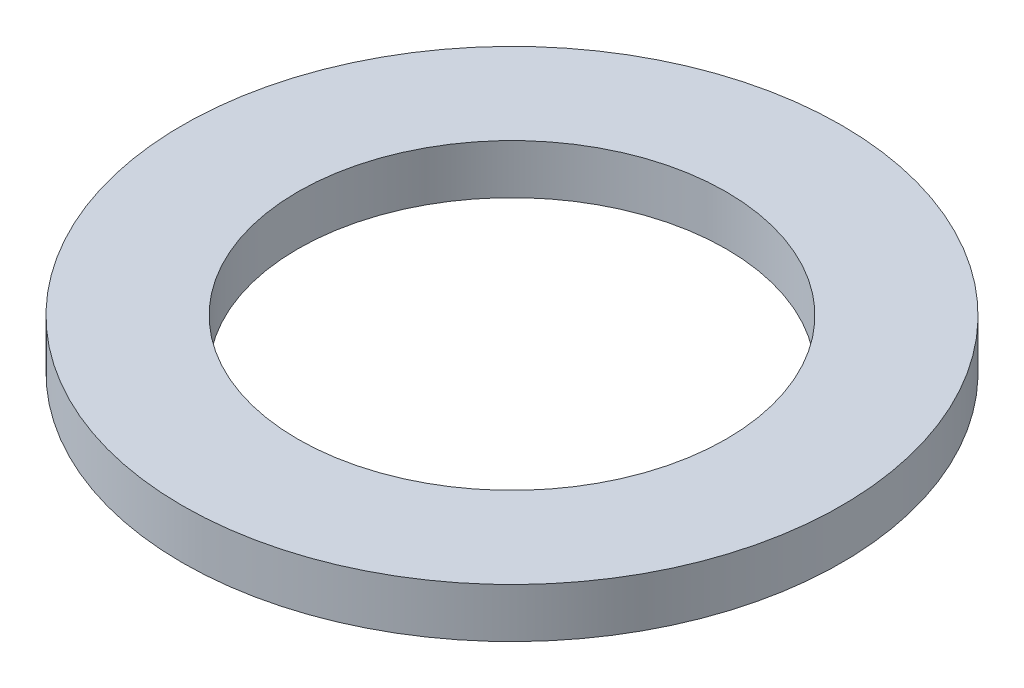
ISO-10303-21;
HEADER;
FILE_DESCRIPTION(('STEP AP214'),'2;1');
FILE_NAME('part.step','',(''),(''),'','','');
FILE_SCHEMA(('AUTOMOTIVE_DESIGN { 1 0 10303 214 1 1 1 1 }'));
ENDSEC;
DATA;
#1=APPLICATION_CONTEXT('core data for automotive mechanical design processes');
#2=APPLICATION_PROTOCOL_DEFINITION('international standard','automotive_design',2000,#1);
#3=PRODUCT_CONTEXT('',#1,'mechanical');
#4=PRODUCT('Part','Part','',(#3));
#5=PRODUCT_RELATED_PRODUCT_CATEGORY('part','',(#4));
#6=PRODUCT_DEFINITION_FORMATION('','',#4);
#7=PRODUCT_DEFINITION_CONTEXT('part definition',#1,'design');
#8=PRODUCT_DEFINITION('design','',#6,#7);
#9=PRODUCT_DEFINITION_SHAPE('','',#8);
#10=(LENGTH_UNIT() NAMED_UNIT(*) SI_UNIT(.MILLI.,.METRE.));
#11=(NAMED_UNIT(*) PLANE_ANGLE_UNIT() SI_UNIT($,.RADIAN.));
#12=(NAMED_UNIT(*) SI_UNIT($,.STERADIAN.) SOLID_ANGLE_UNIT());
#13=UNCERTAINTY_MEASURE_WITH_UNIT(LENGTH_MEASURE(1.E-05),#10,'distance_accuracy_value','');
#14=(GEOMETRIC_REPRESENTATION_CONTEXT(3) GLOBAL_UNCERTAINTY_ASSIGNED_CONTEXT((#13)) GLOBAL_UNIT_ASSIGNED_CONTEXT((#10,
#11,#12)) REPRESENTATION_CONTEXT('',''));
#15=CARTESIAN_POINT('',(0.,0.,0.));
#16=DIRECTION('',(0.,0.,1.));
#17=DIRECTION('',(1.,0.,0.));
#18=AXIS2_PLACEMENT_3D('',#15,#16,#17);
#19=CARTESIAN_POINT('',(0.,3.,0.));
#20=DIRECTION('',(0.,1.,0.));
#21=DIRECTION('',(0.,0.,1.));
#22=AXIS2_PLACEMENT_3D('',#19,#20,#21);
#23=PLANE('',#22);
#24=CARTESIAN_POINT('',(0.,3.,0.));
#25=DIRECTION('',(0.,1.,0.));
#26=DIRECTION('',(0.,0.,1.));
#27=AXIS2_PLACEMENT_3D('',#24,#25,#26);
#28=CIRCLE('',#27,20.);
#29=CARTESIAN_POINT('',(0.,3.,20.));
#30=VERTEX_POINT('',#29);
#31=EDGE_CURVE('E10',#30,#30,#28,.T.);
#32=ORIENTED_EDGE('',*,*,#31,.T.);
#33=EDGE_LOOP('',(#32));
#34=FACE_BOUND('',#33,.T.);
#35=CARTESIAN_POINT('',(0.,3.,0.));
#36=DIRECTION('',(0.,1.,0.));
#37=DIRECTION('',(0.,0.,1.));
#38=AXIS2_PLACEMENT_3D('',#35,#36,#37);
#39=CIRCLE('',#38,13.);
#40=CARTESIAN_POINT('',(0.,3.,13.));
#41=VERTEX_POINT('',#40);
#42=EDGE_CURVE('E43',#41,#41,#39,.T.);
#43=ORIENTED_EDGE('',*,*,#42,.F.);
#44=EDGE_LOOP('',(#43));
#45=FACE_BOUND('',#44,.T.);
#46=ADVANCED_FACE('F32',(#34,#45),#23,.T.);
#47=CARTESIAN_POINT('',(0.,0.,0.));
#48=DIRECTION('',(0.,1.,0.));
#49=DIRECTION('',(0.,0.,1.));
#50=AXIS2_PLACEMENT_3D('',#47,#48,#49);
#51=PLANE('',#50);
#52=CARTESIAN_POINT('',(0.,0.,0.));
#53=DIRECTION('',(0.,1.,0.));
#54=DIRECTION('',(0.,0.,1.));
#55=AXIS2_PLACEMENT_3D('',#52,#53,#54);
#56=CIRCLE('',#55,20.);
#57=CARTESIAN_POINT('',(0.,0.,20.));
#58=VERTEX_POINT('',#57);
#59=EDGE_CURVE('E36',#58,#58,#56,.T.);
#60=ORIENTED_EDGE('',*,*,#59,.F.);
#61=EDGE_LOOP('',(#60));
#62=FACE_BOUND('',#61,.T.);
#63=CARTESIAN_POINT('',(0.,0.,0.));
#64=DIRECTION('',(0.,1.,0.));
#65=DIRECTION('',(0.,0.,1.));
#66=AXIS2_PLACEMENT_3D('',#63,#64,#65);
#67=CIRCLE('',#66,13.);
#68=CARTESIAN_POINT('',(0.,0.,13.));
#69=VERTEX_POINT('',#68);
#70=EDGE_CURVE('E45',#69,#69,#67,.T.);
#71=ORIENTED_EDGE('',*,*,#70,.T.);
#72=EDGE_LOOP('',(#71));
#73=FACE_BOUND('',#72,.T.);
#74=ADVANCED_FACE('F55',(#62,#73),#51,.F.);
#75=CARTESIAN_POINT('',(0.,3.,0.));
#76=DIRECTION('',(0.,-1.,0.));
#77=DIRECTION('',(0.,0.,-1.));
#78=AXIS2_PLACEMENT_3D('',#75,#76,#77);
#79=CYLINDRICAL_SURFACE('',#78,20.);
#80=ORIENTED_EDGE('',*,*,#31,.F.);
#81=EDGE_LOOP('',(#80));
#82=FACE_BOUND('',#81,.T.);
#83=ORIENTED_EDGE('',*,*,#59,.T.);
#84=EDGE_LOOP('',(#83));
#85=FACE_BOUND('',#84,.T.);
#86=ADVANCED_FACE('F34',(#82,#85),#79,.T.);
#87=CARTESIAN_POINT('',(0.,3.,0.));
#88=DIRECTION('',(0.,-1.,0.));
#89=DIRECTION('',(0.,0.,-1.));
#90=AXIS2_PLACEMENT_3D('',#87,#88,#89);
#91=CYLINDRICAL_SURFACE('',#90,13.);
#92=ORIENTED_EDGE('',*,*,#42,.T.);
#93=EDGE_LOOP('',(#92));
#94=FACE_BOUND('',#93,.T.);
#95=ORIENTED_EDGE('',*,*,#70,.F.);
#96=EDGE_LOOP('',(#95));
#97=FACE_BOUND('',#96,.T.);
#98=ADVANCED_FACE('F51',(#94,#97),#91,.F.);
#99=CLOSED_SHELL('',(#46,#74,#86,#98));
#100=MANIFOLD_SOLID_BREP('B2',#99);
#101=ADVANCED_BREP_SHAPE_REPRESENTATION('',(#18,#100),#14);
#102=SHAPE_DEFINITION_REPRESENTATION(#9,#101);
ENDSEC;
END-ISO-10303-21;
